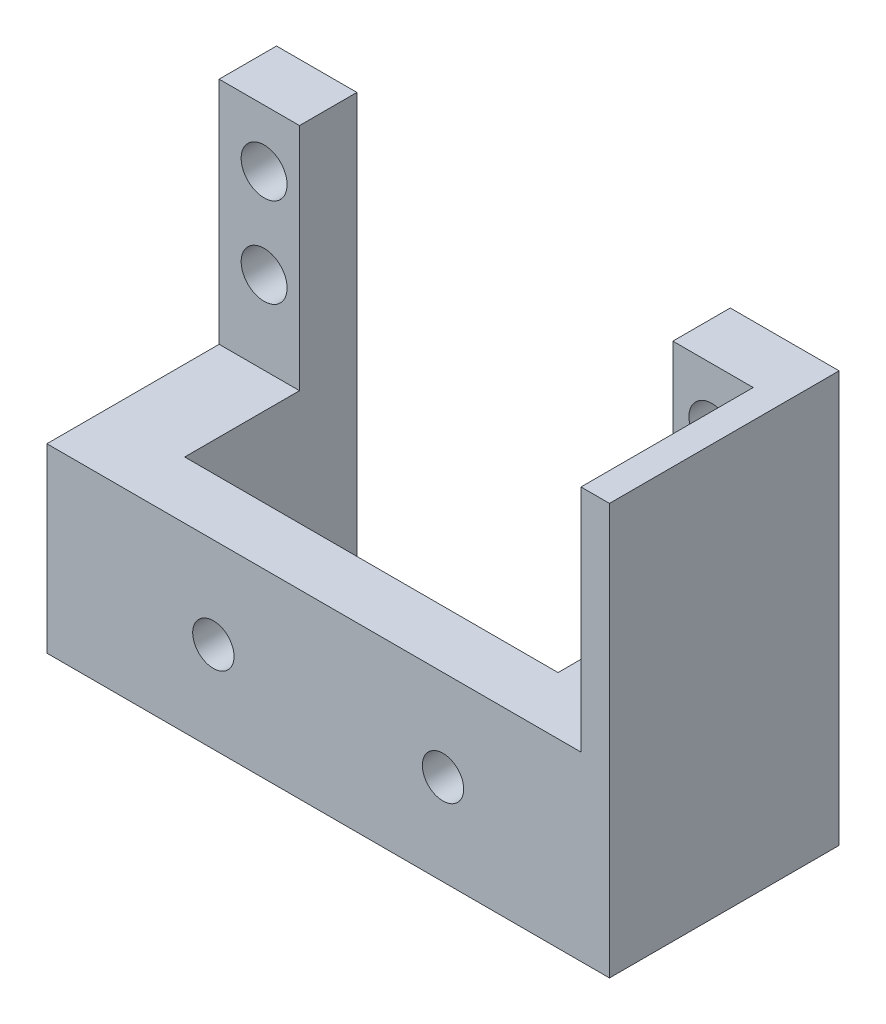
ISO-10303-21;
HEADER;
FILE_DESCRIPTION(('STEP AP214'),'2;1');
FILE_NAME('part.step','',(''),(''),'','','');
FILE_SCHEMA(('AUTOMOTIVE_DESIGN { 1 0 10303 214 1 1 1 1 }'));
ENDSEC;
DATA;
#1=APPLICATION_CONTEXT('core data for automotive mechanical design processes');
#2=APPLICATION_PROTOCOL_DEFINITION('international standard','automotive_design',2000,#1);
#3=PRODUCT_CONTEXT('',#1,'mechanical');
#4=PRODUCT('Part','Part','',(#3));
#5=PRODUCT_RELATED_PRODUCT_CATEGORY('part','',(#4));
#6=PRODUCT_DEFINITION_FORMATION('','',#4);
#7=PRODUCT_DEFINITION_CONTEXT('part definition',#1,'design');
#8=PRODUCT_DEFINITION('design','',#6,#7);
#9=PRODUCT_DEFINITION_SHAPE('','',#8);
#10=(LENGTH_UNIT() NAMED_UNIT(*) SI_UNIT(.MILLI.,.METRE.));
#11=(NAMED_UNIT(*) PLANE_ANGLE_UNIT() SI_UNIT($,.RADIAN.));
#12=(NAMED_UNIT(*) SI_UNIT($,.STERADIAN.) SOLID_ANGLE_UNIT());
#13=UNCERTAINTY_MEASURE_WITH_UNIT(LENGTH_MEASURE(1.E-05),#10,'distance_accuracy_value','');
#14=(GEOMETRIC_REPRESENTATION_CONTEXT(3) GLOBAL_UNCERTAINTY_ASSIGNED_CONTEXT((#13)) GLOBAL_UNIT_ASSIGNED_CONTEXT((#10,
#11,#12)) REPRESENTATION_CONTEXT('',''));
#15=CARTESIAN_POINT('',(0.,0.,0.));
#16=DIRECTION('',(0.,0.,1.));
#17=DIRECTION('',(1.,0.,0.));
#18=AXIS2_PLACEMENT_3D('',#15,#16,#17);
#19=CARTESIAN_POINT('',(0.,0.,0.));
#20=DIRECTION('',(0.,0.,1.));
#21=DIRECTION('',(1.,0.,0.));
#22=AXIS2_PLACEMENT_3D('',#19,#20,#21);
#23=PLANE('',#22);
#24=CARTESIAN_POINT('',(3835.76025563994,30.6160000000002,0.));
#25=DIRECTION('',(0.,0.,1.));
#26=DIRECTION('',(1.,0.,0.));
#27=AXIS2_PLACEMENT_3D('',#24,#25,#26);
#28=CIRCLE('',#27,2.54000000000008);
#29=CARTESIAN_POINT('',(3838.30025563994,30.6160000000002,0.));
#30=VERTEX_POINT('',#29);
#31=EDGE_CURVE('E184',#30,#30,#28,.T.);
#32=ORIENTED_EDGE('',*,*,#31,.T.);
#33=EDGE_LOOP('',(#32));
#34=FACE_BOUND('',#33,.T.);
#35=CARTESIAN_POINT('',(3835.76025563994,20.7100000000002,0.));
#36=DIRECTION('',(0.,0.,1.));
#37=DIRECTION('',(1.,0.,0.));
#38=AXIS2_PLACEMENT_3D('',#35,#36,#37);
#39=CIRCLE('',#38,2.54000000000008);
#40=CARTESIAN_POINT('',(3838.30025563994,20.7100000000002,0.));
#41=VERTEX_POINT('',#40);
#42=EDGE_CURVE('E166',#41,#41,#39,.T.);
#43=ORIENTED_EDGE('',*,*,#42,.T.);
#44=EDGE_LOOP('',(#43));
#45=FACE_BOUND('',#44,.T.);
#46=DIRECTION('',(1.,0.,0.));
#47=VECTOR('',#46,1.);
#48=CARTESIAN_POINT('',(0.,-8.50000000000052,0.));
#49=LINE('',#48,#47);
#50=CARTESIAN_POINT('',(3831.44225563994,-8.49999999999978,0.));
#51=VERTEX_POINT('',#50);
#52=CARTESIAN_POINT('',(3843.48185563994,-8.49999999999977,0.));
#53=VERTEX_POINT('',#52);
#54=EDGE_CURVE('E254',#51,#53,#49,.T.);
#55=ORIENTED_EDGE('',*,*,#54,.F.);
#56=DIRECTION('',(0.,-1.,0.));
#57=VECTOR('',#56,1.);
#58=CARTESIAN_POINT('',(3831.44225563994,36.9660000000002,0.));
#59=LINE('',#58,#57);
#60=CARTESIAN_POINT('',(3831.44225563994,36.9660000000002,0.));
#61=VERTEX_POINT('',#60);
#62=EDGE_CURVE('E135',#61,#51,#59,.T.);
#63=ORIENTED_EDGE('',*,*,#62,.F.);
#64=DIRECTION('',(-1.,0.,0.));
#65=VECTOR('',#64,1.);
#66=CARTESIAN_POINT('',(3843.48185563994,36.9660000000002,0.));
#67=LINE('',#66,#65);
#68=CARTESIAN_POINT('',(3843.48185563994,36.9660000000002,0.));
#69=VERTEX_POINT('',#68);
#70=EDGE_CURVE('E212',#69,#61,#67,.T.);
#71=ORIENTED_EDGE('',*,*,#70,.F.);
#72=DIRECTION('',(0.,-1.,0.));
#73=VECTOR('',#72,1.);
#74=CARTESIAN_POINT('',(3843.48185563994,0.,0.));
#75=LINE('',#74,#73);
#76=EDGE_CURVE('E239',#69,#53,#75,.T.);
#77=ORIENTED_EDGE('',*,*,#76,.T.);
#78=EDGE_LOOP('',(#55,#63,#71,#77));
#79=FACE_BOUND('',#78,.T.);
#80=ADVANCED_FACE('F34',(#34,#45,#79),#23,.F.);
#81=CARTESIAN_POINT('',(0.,11.5660000000002,25.4));
#82=DIRECTION('',(0.,1.,0.));
#83=DIRECTION('',(0.,0.,1.));
#84=AXIS2_PLACEMENT_3D('',#81,#82,#83);
#85=PLANE('',#84);
#86=DIRECTION('',(0.,0.,-1.));
#87=VECTOR('',#86,1.);
#88=CARTESIAN_POINT('',(3831.44225563994,11.5660000000002,19.05));
#89=LINE('',#88,#87);
#90=CARTESIAN_POINT('',(3831.44225563994,11.5660000000002,19.05));
#91=VERTEX_POINT('',#90);
#92=CARTESIAN_POINT('',(3831.44225563994,11.5660000000002,6.35));
#93=VERTEX_POINT('',#92);
#94=EDGE_CURVE('E160',#91,#93,#89,.T.);
#95=ORIENTED_EDGE('',*,*,#94,.F.);
#96=DIRECTION('',(1.,0.,0.));
#97=VECTOR('',#96,1.);
#98=CARTESIAN_POINT('',(3831.44225563994,11.5660000000002,19.05));
#99=LINE('',#98,#97);
#100=CARTESIAN_POINT('',(3790.14185563994,11.5660000000002,19.05));
#101=VERTEX_POINT('',#100);
#102=EDGE_CURVE('E140',#101,#91,#99,.T.);
#103=ORIENTED_EDGE('',*,*,#102,.F.);
#104=DIRECTION('',(0.,0.,-1.));
#105=VECTOR('',#104,1.);
#106=CARTESIAN_POINT('',(3790.14185563994,11.5660000000002,19.05));
#107=LINE('',#106,#105);
#108=CARTESIAN_POINT('',(3790.14185563994,11.5660000000002,6.35));
#109=VERTEX_POINT('',#108);
#110=EDGE_CURVE('E163',#101,#109,#107,.T.);
#111=ORIENTED_EDGE('',*,*,#110,.T.);
#112=DIRECTION('',(1.,0.,0.));
#113=VECTOR('',#112,1.);
#114=CARTESIAN_POINT('',(3790.14185563994,11.5660000000002,6.35));
#115=LINE('',#114,#113);
#116=CARTESIAN_POINT('',(3781.25185563994,11.5660000000002,6.35));
#117=VERTEX_POINT('',#116);
#118=EDGE_CURVE('E190',#117,#109,#115,.T.);
#119=ORIENTED_EDGE('',*,*,#118,.F.);
#120=DIRECTION('',(0.,0.,-1.));
#121=VECTOR('',#120,1.);
#122=CARTESIAN_POINT('',(3781.25185563994,11.5660000000002,25.4));
#123=LINE('',#122,#121);
#124=CARTESIAN_POINT('',(3781.25185563994,11.5660000000002,25.4));
#125=VERTEX_POINT('',#124);
#126=EDGE_CURVE('E11',#125,#117,#123,.T.);
#127=ORIENTED_EDGE('',*,*,#126,.F.);
#128=DIRECTION('',(1.,0.,0.));
#129=VECTOR('',#128,1.);
#130=CARTESIAN_POINT('',(0.,11.5660000000002,25.4));
#131=LINE('',#130,#129);
#132=CARTESIAN_POINT('',(3840.33225563994,11.5660000000002,25.4));
#133=VERTEX_POINT('',#132);
#134=EDGE_CURVE('E56',#125,#133,#131,.T.);
#135=ORIENTED_EDGE('',*,*,#134,.T.);
#136=DIRECTION('',(0.,0.,1.));
#137=VECTOR('',#136,1.);
#138=CARTESIAN_POINT('',(3840.33225563994,11.5660000000002,6.35));
#139=LINE('',#138,#137);
#140=CARTESIAN_POINT('',(3840.33225563994,11.5660000000002,6.35));
#141=VERTEX_POINT('',#140);
#142=EDGE_CURVE('E51',#141,#133,#139,.T.);
#143=ORIENTED_EDGE('',*,*,#142,.F.);
#144=DIRECTION('',(1.,0.,0.));
#145=VECTOR('',#144,1.);
#146=CARTESIAN_POINT('',(3831.44225563994,11.5660000000002,6.35));
#147=LINE('',#146,#145);
#148=EDGE_CURVE('E197',#93,#141,#147,.T.);
#149=ORIENTED_EDGE('',*,*,#148,.F.);
#150=EDGE_LOOP('',(#95,#103,#111,#119,#127,#135,#143,#149));
#151=FACE_BOUND('',#150,.T.);
#152=ADVANCED_FACE('F309',(#151),#85,.T.);
#153=CARTESIAN_POINT('',(3843.48185563994,0.,25.4));
#154=DIRECTION('',(1.,0.,0.));
#155=DIRECTION('',(0.,0.,-1.));
#156=AXIS2_PLACEMENT_3D('',#153,#154,#155);
#157=PLANE('',#156);
#158=ORIENTED_EDGE('',*,*,#76,.F.);
#159=DIRECTION('',(0.,0.,-1.));
#160=VECTOR('',#159,1.);
#161=CARTESIAN_POINT('',(3843.48185563994,36.9660000000002,25.4));
#162=LINE('',#161,#160);
#163=CARTESIAN_POINT('',(3843.48185563994,36.9660000000002,25.4));
#164=VERTEX_POINT('',#163);
#165=EDGE_CURVE('E224',#164,#69,#162,.T.);
#166=ORIENTED_EDGE('',*,*,#165,.F.);
#167=DIRECTION('',(0.,-1.,0.));
#168=VECTOR('',#167,1.);
#169=CARTESIAN_POINT('',(3843.48185563994,0.,25.4));
#170=LINE('',#169,#168);
#171=CARTESIAN_POINT('',(3843.48185563994,-8.49999999999977,25.4));
#172=VERTEX_POINT('',#171);
#173=EDGE_CURVE('E240',#164,#172,#170,.T.);
#174=ORIENTED_EDGE('',*,*,#173,.T.);
#175=DIRECTION('',(0.,0.,-1.));
#176=VECTOR('',#175,1.);
#177=CARTESIAN_POINT('',(3843.48185563994,-8.49999999999977,25.4));
#178=LINE('',#177,#176);
#179=EDGE_CURVE('E249',#172,#53,#178,.T.);
#180=ORIENTED_EDGE('',*,*,#179,.T.);
#181=EDGE_LOOP('',(#158,#166,#174,#180));
#182=FACE_BOUND('',#181,.T.);
#183=ADVANCED_FACE('F36',(#182),#157,.T.);
#184=CARTESIAN_POINT('',(3781.25185563994,0.,25.4));
#185=DIRECTION('',(1.,0.,0.));
#186=DIRECTION('',(0.,0.,-1.));
#187=AXIS2_PLACEMENT_3D('',#184,#185,#186);
#188=PLANE('',#187);
#189=DIRECTION('',(0.,-1.,0.));
#190=VECTOR('',#189,1.);
#191=CARTESIAN_POINT('',(3781.25185563994,0.,0.));
#192=LINE('',#191,#190);
#193=CARTESIAN_POINT('',(3781.25185563994,36.9660000000002,0.));
#194=VERTEX_POINT('',#193);
#195=CARTESIAN_POINT('',(3781.25185563994,-8.49999999999978,0.));
#196=VERTEX_POINT('',#195);
#197=EDGE_CURVE('E252',#194,#196,#192,.T.);
#198=ORIENTED_EDGE('',*,*,#197,.T.);
#199=DIRECTION('',(0.,0.,-1.));
#200=VECTOR('',#199,1.);
#201=CARTESIAN_POINT('',(3781.25185563994,-8.49999999999978,25.4));
#202=LINE('',#201,#200);
#203=CARTESIAN_POINT('',(3781.25185563994,-8.49999999999978,25.4));
#204=VERTEX_POINT('',#203);
#205=EDGE_CURVE('E43',#204,#196,#202,.T.);
#206=ORIENTED_EDGE('',*,*,#205,.F.);
#207=DIRECTION('',(0.,-1.,0.));
#208=VECTOR('',#207,1.);
#209=CARTESIAN_POINT('',(3781.25185563994,0.,25.4));
#210=LINE('',#209,#208);
#211=EDGE_CURVE('E245',#125,#204,#210,.T.);
#212=ORIENTED_EDGE('',*,*,#211,.F.);
#213=ORIENTED_EDGE('',*,*,#126,.T.);
#214=DIRECTION('',(0.,-1.,0.));
#215=VECTOR('',#214,1.);
#216=CARTESIAN_POINT('',(3781.25185563994,47.8909530891444,6.35));
#217=LINE('',#216,#215);
#218=CARTESIAN_POINT('',(3781.25185563994,36.9660000000002,6.35));
#219=VERTEX_POINT('',#218);
#220=EDGE_CURVE('E187',#219,#117,#217,.T.);
#221=ORIENTED_EDGE('',*,*,#220,.F.);
#222=DIRECTION('',(0.,0.,1.));
#223=VECTOR('',#222,1.);
#224=CARTESIAN_POINT('',(3781.25185563994,36.9660000000002,6.35));
#225=LINE('',#224,#223);
#226=EDGE_CURVE('E201',#194,#219,#225,.T.);
#227=ORIENTED_EDGE('',*,*,#226,.F.);
#228=EDGE_LOOP('',(#198,#206,#212,#213,#221,#227));
#229=FACE_BOUND('',#228,.T.);
#230=ADVANCED_FACE('F302',(#229),#188,.F.);
#231=CARTESIAN_POINT('',(0.,-8.50000000000052,25.4));
#232=DIRECTION('',(0.,1.,0.));
#233=DIRECTION('',(-1.,0.,0.));
#234=AXIS2_PLACEMENT_3D('',#231,#232,#233);
#235=PLANE('',#234);
#236=DIRECTION('',(-1.,0.,0.));
#237=VECTOR('',#236,1.);
#238=CARTESIAN_POINT('',(3831.44225563994,-8.49999999999978,19.05));
#239=LINE('',#238,#237);
#240=CARTESIAN_POINT('',(3831.44225563994,-8.49999999999978,19.05));
#241=VERTEX_POINT('',#240);
#242=CARTESIAN_POINT('',(3790.14185563994,-8.49999999999978,19.05));
#243=VERTEX_POINT('',#242);
#244=EDGE_CURVE('E146',#241,#243,#239,.T.);
#245=ORIENTED_EDGE('',*,*,#244,.F.);
#246=DIRECTION('',(0.,0.,-1.));
#247=VECTOR('',#246,1.);
#248=CARTESIAN_POINT('',(3831.44225563994,-8.49999999999978,19.05));
#249=LINE('',#248,#247);
#250=EDGE_CURVE('E129',#241,#51,#249,.T.);
#251=ORIENTED_EDGE('',*,*,#250,.T.);
#252=ORIENTED_EDGE('',*,*,#54,.T.);
#253=ORIENTED_EDGE('',*,*,#179,.F.);
#254=DIRECTION('',(1.,0.,0.));
#255=VECTOR('',#254,1.);
#256=CARTESIAN_POINT('',(0.,-8.50000000000052,25.4));
#257=LINE('',#256,#255);
#258=EDGE_CURVE('E247',#204,#172,#257,.T.);
#259=ORIENTED_EDGE('',*,*,#258,.F.);
#260=ORIENTED_EDGE('',*,*,#205,.T.);
#261=CARTESIAN_POINT('',(3790.14185563994,-8.49999999999978,0.));
#262=VERTEX_POINT('',#261);
#263=EDGE_CURVE('E243',#196,#262,#49,.T.);
#264=ORIENTED_EDGE('',*,*,#263,.T.);
#265=DIRECTION('',(0.,0.,-1.));
#266=VECTOR('',#265,1.);
#267=CARTESIAN_POINT('',(3790.14185563994,-8.49999999999978,19.05));
#268=LINE('',#267,#266);
#269=EDGE_CURVE('E139',#243,#262,#268,.T.);
#270=ORIENTED_EDGE('',*,*,#269,.F.);
#271=EDGE_LOOP('',(#245,#251,#252,#253,#259,#260,#264,#270));
#272=FACE_BOUND('',#271,.T.);
#273=ADVANCED_FACE('F151',(#272),#235,.F.);
#274=CARTESIAN_POINT('',(0.,0.,25.4));
#275=DIRECTION('',(0.,0.,1.));
#276=DIRECTION('',(1.,0.,0.));
#277=AXIS2_PLACEMENT_3D('',#274,#275,#276);
#278=PLANE('',#277);
#279=CARTESIAN_POINT('',(3799.66685563994,1.53300000000022,25.4));
#280=DIRECTION('',(0.,0.,1.));
#281=DIRECTION('',(1.,0.,0.));
#282=AXIS2_PLACEMENT_3D('',#279,#280,#281);
#283=CIRCLE('',#282,2.2859999999997);
#284=CARTESIAN_POINT('',(3801.95285563994,1.53300000000022,25.4));
#285=VERTEX_POINT('',#284);
#286=EDGE_CURVE('E261',#285,#285,#283,.T.);
#287=ORIENTED_EDGE('',*,*,#286,.F.);
#288=EDGE_LOOP('',(#287));
#289=FACE_BOUND('',#288,.T.);
#290=CARTESIAN_POINT('',(3825.06685563994,1.53300000000022,25.4));
#291=DIRECTION('',(0.,0.,1.));
#292=DIRECTION('',(1.,0.,0.));
#293=AXIS2_PLACEMENT_3D('',#290,#291,#292);
#294=CIRCLE('',#293,2.2859999999997);
#295=CARTESIAN_POINT('',(3827.35285563994,1.53300000000022,25.4));
#296=VERTEX_POINT('',#295);
#297=EDGE_CURVE('E266',#296,#296,#294,.T.);
#298=ORIENTED_EDGE('',*,*,#297,.F.);
#299=EDGE_LOOP('',(#298));
#300=FACE_BOUND('',#299,.T.);
#301=ORIENTED_EDGE('',*,*,#173,.F.);
#302=DIRECTION('',(1.,0.,0.));
#303=VECTOR('',#302,1.);
#304=CARTESIAN_POINT('',(3840.33225563994,36.9660000000002,25.4));
#305=LINE('',#304,#303);
#306=CARTESIAN_POINT('',(3840.33225563994,36.9660000000002,25.4));
#307=VERTEX_POINT('',#306);
#308=EDGE_CURVE('E221',#307,#164,#305,.T.);
#309=ORIENTED_EDGE('',*,*,#308,.F.);
#310=DIRECTION('',(0.,-1.,0.));
#311=VECTOR('',#310,1.);
#312=CARTESIAN_POINT('',(3840.33225563994,36.9660000000002,25.4));
#313=LINE('',#312,#311);
#314=EDGE_CURVE('E227',#307,#133,#313,.T.);
#315=ORIENTED_EDGE('',*,*,#314,.T.);
#316=ORIENTED_EDGE('',*,*,#134,.F.);
#317=ORIENTED_EDGE('',*,*,#211,.T.);
#318=ORIENTED_EDGE('',*,*,#258,.T.);
#319=EDGE_LOOP('',(#301,#309,#315,#316,#317,#318));
#320=FACE_BOUND('',#319,.T.);
#321=ADVANCED_FACE('F275',(#289,#300,#320),#278,.T.);
#322=CARTESIAN_POINT('',(3786.23025563994,30.6160000000002,0.));
#323=DIRECTION('',(0.,0.,1.));
#324=DIRECTION('',(1.,0.,0.));
#325=AXIS2_PLACEMENT_3D('',#322,#323,#324);
#326=CIRCLE('',#325,2.54000000000008);
#327=CARTESIAN_POINT('',(3788.77025563994,30.6160000000002,0.));
#328=VERTEX_POINT('',#327);
#329=EDGE_CURVE('E179',#328,#328,#326,.T.);
#330=ORIENTED_EDGE('',*,*,#329,.T.);
#331=EDGE_LOOP('',(#330));
#332=FACE_BOUND('',#331,.T.);
#333=CARTESIAN_POINT('',(3786.23025563994,20.7100000000002,0.));
#334=DIRECTION('',(0.,0.,1.));
#335=DIRECTION('',(1.,0.,0.));
#336=AXIS2_PLACEMENT_3D('',#333,#334,#335);
#337=CIRCLE('',#336,2.54000000000008);
#338=CARTESIAN_POINT('',(3788.77025563994,20.7100000000002,0.));
#339=VERTEX_POINT('',#338);
#340=EDGE_CURVE('E173',#339,#339,#337,.T.);
#341=ORIENTED_EDGE('',*,*,#340,.T.);
#342=EDGE_LOOP('',(#341));
#343=FACE_BOUND('',#342,.T.);
#344=DIRECTION('',(0.,-1.,0.));
#345=VECTOR('',#344,1.);
#346=CARTESIAN_POINT('',(3790.14185563994,47.8909530891444,0.));
#347=LINE('',#346,#345);
#348=CARTESIAN_POINT('',(3790.14185563994,36.9660000000002,0.));
#349=VERTEX_POINT('',#348);
#350=EDGE_CURVE('E207',#349,#262,#347,.T.);
#351=ORIENTED_EDGE('',*,*,#350,.T.);
#352=ORIENTED_EDGE('',*,*,#263,.F.);
#353=ORIENTED_EDGE('',*,*,#197,.F.);
#354=DIRECTION('',(-1.,0.,0.));
#355=VECTOR('',#354,1.);
#356=CARTESIAN_POINT('',(3781.25185563994,36.9660000000002,0.));
#357=LINE('',#356,#355);
#358=EDGE_CURVE('E204',#349,#194,#357,.T.);
#359=ORIENTED_EDGE('',*,*,#358,.F.);
#360=EDGE_LOOP('',(#351,#352,#353,#359));
#361=FACE_BOUND('',#360,.T.);
#362=ADVANCED_FACE('F278',(#332,#343,#361),#23,.F.);
#363=CARTESIAN_POINT('',(3831.44225563994,36.9660000000002,0.));
#364=DIRECTION('',(1.,0.,0.));
#365=DIRECTION('',(0.,0.,-1.));
#366=AXIS2_PLACEMENT_3D('',#363,#364,#365);
#367=PLANE('',#366);
#368=ORIENTED_EDGE('',*,*,#62,.T.);
#369=ORIENTED_EDGE('',*,*,#250,.F.);
#370=DIRECTION('',(0.,-1.,0.));
#371=VECTOR('',#370,1.);
#372=CARTESIAN_POINT('',(3831.44225563994,11.5660000000002,19.05));
#373=LINE('',#372,#371);
#374=EDGE_CURVE('E132',#91,#241,#373,.T.);
#375=ORIENTED_EDGE('',*,*,#374,.F.);
#376=ORIENTED_EDGE('',*,*,#94,.T.);
#377=DIRECTION('',(0.,-1.,0.));
#378=VECTOR('',#377,1.);
#379=CARTESIAN_POINT('',(3831.44225563994,36.9660000000002,6.35));
#380=LINE('',#379,#378);
#381=CARTESIAN_POINT('',(3831.44225563994,36.9660000000002,6.35));
#382=VERTEX_POINT('',#381);
#383=EDGE_CURVE('E235',#382,#93,#380,.T.);
#384=ORIENTED_EDGE('',*,*,#383,.F.);
#385=DIRECTION('',(0.,0.,1.));
#386=VECTOR('',#385,1.);
#387=CARTESIAN_POINT('',(3831.44225563994,36.9660000000002,0.));
#388=LINE('',#387,#386);
#389=EDGE_CURVE('E215',#61,#382,#388,.T.);
#390=ORIENTED_EDGE('',*,*,#389,.F.);
#391=EDGE_LOOP('',(#368,#369,#375,#376,#384,#390));
#392=FACE_BOUND('',#391,.T.);
#393=ADVANCED_FACE('F131',(#392),#367,.F.);
#394=CARTESIAN_POINT('',(3831.44225563994,36.9660000000002,6.35));
#395=DIRECTION('',(0.,0.,-1.));
#396=DIRECTION('',(-1.,0.,0.));
#397=AXIS2_PLACEMENT_3D('',#394,#395,#396);
#398=PLANE('',#397);
#399=CARTESIAN_POINT('',(3835.76025563994,20.7100000000002,6.35));
#400=DIRECTION('',(0.,0.,1.));
#401=DIRECTION('',(1.,0.,0.));
#402=AXIS2_PLACEMENT_3D('',#399,#400,#401);
#403=CIRCLE('',#402,2.54000000000008);
#404=CARTESIAN_POINT('',(3838.30025563994,20.7100000000002,6.35));
#405=VERTEX_POINT('',#404);
#406=EDGE_CURVE('E170',#405,#405,#403,.T.);
#407=ORIENTED_EDGE('',*,*,#406,.F.);
#408=EDGE_LOOP('',(#407));
#409=FACE_BOUND('',#408,.T.);
#410=CARTESIAN_POINT('',(3835.76025563994,30.6160000000002,6.35));
#411=DIRECTION('',(0.,0.,1.));
#412=DIRECTION('',(1.,0.,0.));
#413=AXIS2_PLACEMENT_3D('',#410,#411,#412);
#414=CIRCLE('',#413,2.54000000000008);
#415=CARTESIAN_POINT('',(3838.30025563994,30.6160000000002,6.35));
#416=VERTEX_POINT('',#415);
#417=EDGE_CURVE('E169',#416,#416,#414,.T.);
#418=ORIENTED_EDGE('',*,*,#417,.F.);
#419=EDGE_LOOP('',(#418));
#420=FACE_BOUND('',#419,.T.);
#421=ORIENTED_EDGE('',*,*,#148,.T.);
#422=DIRECTION('',(0.,-1.,0.));
#423=VECTOR('',#422,1.);
#424=CARTESIAN_POINT('',(3840.33225563994,36.9660000000002,6.35));
#425=LINE('',#424,#423);
#426=CARTESIAN_POINT('',(3840.33225563994,36.9660000000002,6.35));
#427=VERTEX_POINT('',#426);
#428=EDGE_CURVE('E232',#427,#141,#425,.T.);
#429=ORIENTED_EDGE('',*,*,#428,.F.);
#430=DIRECTION('',(1.,0.,0.));
#431=VECTOR('',#430,1.);
#432=CARTESIAN_POINT('',(3831.44225563994,36.9660000000002,6.35));
#433=LINE('',#432,#431);
#434=EDGE_CURVE('E217',#382,#427,#433,.T.);
#435=ORIENTED_EDGE('',*,*,#434,.F.);
#436=ORIENTED_EDGE('',*,*,#383,.T.);
#437=EDGE_LOOP('',(#421,#429,#435,#436));
#438=FACE_BOUND('',#437,.T.);
#439=ADVANCED_FACE('F296',(#409,#420,#438),#398,.F.);
#440=CARTESIAN_POINT('',(3840.33225563994,36.9660000000002,6.35));
#441=DIRECTION('',(1.,0.,0.));
#442=DIRECTION('',(0.,0.,-1.));
#443=AXIS2_PLACEMENT_3D('',#440,#441,#442);
#444=PLANE('',#443);
#445=ORIENTED_EDGE('',*,*,#142,.T.);
#446=ORIENTED_EDGE('',*,*,#314,.F.);
#447=DIRECTION('',(0.,0.,1.));
#448=VECTOR('',#447,1.);
#449=CARTESIAN_POINT('',(3840.33225563994,36.9660000000002,6.35));
#450=LINE('',#449,#448);
#451=EDGE_CURVE('E219',#427,#307,#450,.T.);
#452=ORIENTED_EDGE('',*,*,#451,.F.);
#453=ORIENTED_EDGE('',*,*,#428,.T.);
#454=EDGE_LOOP('',(#445,#446,#452,#453));
#455=FACE_BOUND('',#454,.T.);
#456=ADVANCED_FACE('F298',(#455),#444,.F.);
#457=CARTESIAN_POINT('',(0.,36.9660000000002,0.));
#458=DIRECTION('',(0.,1.,0.));
#459=DIRECTION('',(0.,0.,1.));
#460=AXIS2_PLACEMENT_3D('',#457,#458,#459);
#461=PLANE('',#460);
#462=ORIENTED_EDGE('',*,*,#70,.T.);
#463=ORIENTED_EDGE('',*,*,#389,.T.);
#464=ORIENTED_EDGE('',*,*,#434,.T.);
#465=ORIENTED_EDGE('',*,*,#451,.T.);
#466=ORIENTED_EDGE('',*,*,#308,.T.);
#467=ORIENTED_EDGE('',*,*,#165,.T.);
#468=EDGE_LOOP('',(#462,#463,#464,#465,#466,#467));
#469=FACE_BOUND('',#468,.T.);
#470=ADVANCED_FACE('F287',(#469),#461,.T.);
#471=CARTESIAN_POINT('',(3790.14185563994,47.8909530891444,6.35));
#472=DIRECTION('',(0.,0.,-1.));
#473=DIRECTION('',(-1.,0.,0.));
#474=AXIS2_PLACEMENT_3D('',#471,#472,#473);
#475=PLANE('',#474);
#476=CARTESIAN_POINT('',(3786.23025563994,30.6160000000002,6.35));
#477=DIRECTION('',(0.,0.,1.));
#478=DIRECTION('',(1.,0.,0.));
#479=AXIS2_PLACEMENT_3D('',#476,#477,#478);
#480=CIRCLE('',#479,2.54000000000008);
#481=CARTESIAN_POINT('',(3788.77025563994,30.6160000000002,6.35));
#482=VERTEX_POINT('',#481);
#483=EDGE_CURVE('E162',#482,#482,#480,.T.);
#484=ORIENTED_EDGE('',*,*,#483,.F.);
#485=EDGE_LOOP('',(#484));
#486=FACE_BOUND('',#485,.T.);
#487=CARTESIAN_POINT('',(3786.23025563994,20.7100000000002,6.35));
#488=DIRECTION('',(0.,0.,1.));
#489=DIRECTION('',(1.,0.,0.));
#490=AXIS2_PLACEMENT_3D('',#487,#488,#489);
#491=CIRCLE('',#490,2.54000000000008);
#492=CARTESIAN_POINT('',(3788.77025563994,20.7100000000002,6.35));
#493=VERTEX_POINT('',#492);
#494=EDGE_CURVE('E176',#493,#493,#491,.T.);
#495=ORIENTED_EDGE('',*,*,#494,.F.);
#496=EDGE_LOOP('',(#495));
#497=FACE_BOUND('',#496,.T.);
#498=DIRECTION('',(1.,0.,0.));
#499=VECTOR('',#498,1.);
#500=CARTESIAN_POINT('',(3790.14185563994,36.9660000000002,6.35));
#501=LINE('',#500,#499);
#502=CARTESIAN_POINT('',(3790.14185563994,36.9660000000002,6.35));
#503=VERTEX_POINT('',#502);
#504=EDGE_CURVE('E198',#219,#503,#501,.T.);
#505=ORIENTED_EDGE('',*,*,#504,.F.);
#506=ORIENTED_EDGE('',*,*,#220,.T.);
#507=ORIENTED_EDGE('',*,*,#118,.T.);
#508=DIRECTION('',(0.,-1.,0.));
#509=VECTOR('',#508,1.);
#510=CARTESIAN_POINT('',(3790.14185563994,47.8909530891444,6.35));
#511=LINE('',#510,#509);
#512=EDGE_CURVE('E193',#503,#109,#511,.T.);
#513=ORIENTED_EDGE('',*,*,#512,.F.);
#514=EDGE_LOOP('',(#505,#506,#507,#513));
#515=FACE_BOUND('',#514,.T.);
#516=ADVANCED_FACE('F313',(#486,#497,#515),#475,.F.);
#517=CARTESIAN_POINT('',(3790.14185563994,47.8909530891444,0.));
#518=DIRECTION('',(-1.,0.,0.));
#519=DIRECTION('',(0.,0.,1.));
#520=AXIS2_PLACEMENT_3D('',#517,#518,#519);
#521=PLANE('',#520);
#522=DIRECTION('',(0.,0.,-1.));
#523=VECTOR('',#522,1.);
#524=CARTESIAN_POINT('',(3790.14185563994,36.9660000000002,0.));
#525=LINE('',#524,#523);
#526=EDGE_CURVE('E194',#503,#349,#525,.T.);
#527=ORIENTED_EDGE('',*,*,#526,.F.);
#528=ORIENTED_EDGE('',*,*,#512,.T.);
#529=ORIENTED_EDGE('',*,*,#110,.F.);
#530=DIRECTION('',(0.,1.,0.));
#531=VECTOR('',#530,1.);
#532=CARTESIAN_POINT('',(3790.14185563994,11.5660000000002,19.05));
#533=LINE('',#532,#531);
#534=EDGE_CURVE('E154',#243,#101,#533,.T.);
#535=ORIENTED_EDGE('',*,*,#534,.F.);
#536=ORIENTED_EDGE('',*,*,#269,.T.);
#537=ORIENTED_EDGE('',*,*,#350,.F.);
#538=EDGE_LOOP('',(#527,#528,#529,#535,#536,#537));
#539=FACE_BOUND('',#538,.T.);
#540=ADVANCED_FACE('F308',(#539),#521,.F.);
#541=CARTESIAN_POINT('',(0.,36.9660000000002,0.));
#542=DIRECTION('',(0.,1.,0.));
#543=DIRECTION('',(0.,0.,1.));
#544=AXIS2_PLACEMENT_3D('',#541,#542,#543);
#545=PLANE('',#544);
#546=ORIENTED_EDGE('',*,*,#358,.T.);
#547=ORIENTED_EDGE('',*,*,#226,.T.);
#548=ORIENTED_EDGE('',*,*,#504,.T.);
#549=ORIENTED_EDGE('',*,*,#526,.T.);
#550=EDGE_LOOP('',(#546,#547,#548,#549));
#551=FACE_BOUND('',#550,.T.);
#552=ADVANCED_FACE('F316',(#551),#545,.T.);
#553=CARTESIAN_POINT('',(3786.23025563994,20.7100000000002,0.));
#554=DIRECTION('',(0.,0.,1.));
#555=DIRECTION('',(1.,0.,0.));
#556=AXIS2_PLACEMENT_3D('',#553,#554,#555);
#557=CYLINDRICAL_SURFACE('',#556,2.54000000000008);
#558=ORIENTED_EDGE('',*,*,#340,.F.);
#559=EDGE_LOOP('',(#558));
#560=FACE_BOUND('',#559,.T.);
#561=ORIENTED_EDGE('',*,*,#494,.T.);
#562=EDGE_LOOP('',(#561));
#563=FACE_BOUND('',#562,.T.);
#564=ADVANCED_FACE('F318',(#560,#563),#557,.F.);
#565=CARTESIAN_POINT('',(3786.23025563994,30.6160000000002,0.));
#566=DIRECTION('',(0.,0.,1.));
#567=DIRECTION('',(1.,0.,0.));
#568=AXIS2_PLACEMENT_3D('',#565,#566,#567);
#569=CYLINDRICAL_SURFACE('',#568,2.54000000000008);
#570=ORIENTED_EDGE('',*,*,#329,.F.);
#571=EDGE_LOOP('',(#570));
#572=FACE_BOUND('',#571,.T.);
#573=ORIENTED_EDGE('',*,*,#483,.T.);
#574=EDGE_LOOP('',(#573));
#575=FACE_BOUND('',#574,.T.);
#576=ADVANCED_FACE('F324',(#572,#575),#569,.F.);
#577=CARTESIAN_POINT('',(3835.76025563994,30.6160000000002,0.));
#578=DIRECTION('',(0.,0.,1.));
#579=DIRECTION('',(1.,0.,0.));
#580=AXIS2_PLACEMENT_3D('',#577,#578,#579);
#581=CYLINDRICAL_SURFACE('',#580,2.54000000000008);
#582=ORIENTED_EDGE('',*,*,#31,.F.);
#583=EDGE_LOOP('',(#582));
#584=FACE_BOUND('',#583,.T.);
#585=ORIENTED_EDGE('',*,*,#417,.T.);
#586=EDGE_LOOP('',(#585));
#587=FACE_BOUND('',#586,.T.);
#588=ADVANCED_FACE('F357',(#584,#587),#581,.F.);
#589=CARTESIAN_POINT('',(3835.76025563994,20.7100000000002,0.));
#590=DIRECTION('',(0.,0.,1.));
#591=DIRECTION('',(1.,0.,0.));
#592=AXIS2_PLACEMENT_3D('',#589,#590,#591);
#593=CYLINDRICAL_SURFACE('',#592,2.54000000000008);
#594=ORIENTED_EDGE('',*,*,#42,.F.);
#595=EDGE_LOOP('',(#594));
#596=FACE_BOUND('',#595,.T.);
#597=ORIENTED_EDGE('',*,*,#406,.T.);
#598=EDGE_LOOP('',(#597));
#599=FACE_BOUND('',#598,.T.);
#600=ADVANCED_FACE('F360',(#596,#599),#593,.F.);
#601=CARTESIAN_POINT('',(0.,0.,19.05));
#602=DIRECTION('',(0.,0.,-1.));
#603=DIRECTION('',(-1.,0.,0.));
#604=AXIS2_PLACEMENT_3D('',#601,#602,#603);
#605=PLANE('',#604);
#606=CARTESIAN_POINT('',(3799.66685563994,1.53300000000022,19.05));
#607=DIRECTION('',(0.,0.,-1.));
#608=DIRECTION('',(-1.,0.,0.));
#609=AXIS2_PLACEMENT_3D('',#606,#607,#608);
#610=CIRCLE('',#609,2.2859999999997);
#611=CARTESIAN_POINT('',(3797.38085563994,1.53300000000022,19.05));
#612=VERTEX_POINT('',#611);
#613=EDGE_CURVE('E38',#612,#612,#610,.T.);
#614=ORIENTED_EDGE('',*,*,#613,.F.);
#615=EDGE_LOOP('',(#614));
#616=FACE_BOUND('',#615,.T.);
#617=CARTESIAN_POINT('',(3825.06685563994,1.53300000000022,19.05));
#618=DIRECTION('',(0.,0.,-1.));
#619=DIRECTION('',(-1.,0.,0.));
#620=AXIS2_PLACEMENT_3D('',#617,#618,#619);
#621=CIRCLE('',#620,2.2859999999997);
#622=CARTESIAN_POINT('',(3822.78085563994,1.53300000000022,19.05));
#623=VERTEX_POINT('',#622);
#624=EDGE_CURVE('E259',#623,#623,#621,.T.);
#625=ORIENTED_EDGE('',*,*,#624,.F.);
#626=EDGE_LOOP('',(#625));
#627=FACE_BOUND('',#626,.T.);
#628=ORIENTED_EDGE('',*,*,#374,.T.);
#629=ORIENTED_EDGE('',*,*,#244,.T.);
#630=ORIENTED_EDGE('',*,*,#534,.T.);
#631=ORIENTED_EDGE('',*,*,#102,.T.);
#632=EDGE_LOOP('',(#628,#629,#630,#631));
#633=FACE_BOUND('',#632,.T.);
#634=ADVANCED_FACE('F144',(#616,#627,#633),#605,.T.);
#635=CARTESIAN_POINT('',(3825.06685563994,1.53300000000022,0.));
#636=DIRECTION('',(0.,0.,1.));
#637=DIRECTION('',(1.,0.,0.));
#638=AXIS2_PLACEMENT_3D('',#635,#636,#637);
#639=CYLINDRICAL_SURFACE('',#638,2.2859999999997);
#640=ORIENTED_EDGE('',*,*,#624,.T.);
#641=EDGE_LOOP('',(#640));
#642=FACE_BOUND('',#641,.T.);
#643=ORIENTED_EDGE('',*,*,#297,.T.);
#644=EDGE_LOOP('',(#643));
#645=FACE_BOUND('',#644,.T.);
#646=ADVANCED_FACE('F273',(#642,#645),#639,.F.);
#647=CARTESIAN_POINT('',(3799.66685563994,1.53300000000022,0.));
#648=DIRECTION('',(0.,0.,1.));
#649=DIRECTION('',(1.,0.,0.));
#650=AXIS2_PLACEMENT_3D('',#647,#648,#649);
#651=CYLINDRICAL_SURFACE('',#650,2.2859999999997);
#652=ORIENTED_EDGE('',*,*,#613,.T.);
#653=EDGE_LOOP('',(#652));
#654=FACE_BOUND('',#653,.T.);
#655=ORIENTED_EDGE('',*,*,#286,.T.);
#656=EDGE_LOOP('',(#655));
#657=FACE_BOUND('',#656,.T.);
#658=ADVANCED_FACE('F373',(#654,#657),#651,.F.);
#659=CLOSED_SHELL('',(#80,#152,#183,#230,#273,#321,#362,#393,#439,#456,#470,#516,#540,#552,#564,
#576,#588,#600,#634,#646,#658));
#660=MANIFOLD_SOLID_BREP('B2',#659);
#661=ADVANCED_BREP_SHAPE_REPRESENTATION('',(#18,#660),#14);
#662=SHAPE_DEFINITION_REPRESENTATION(#9,#661);
ENDSEC;
END-ISO-10303-21;
